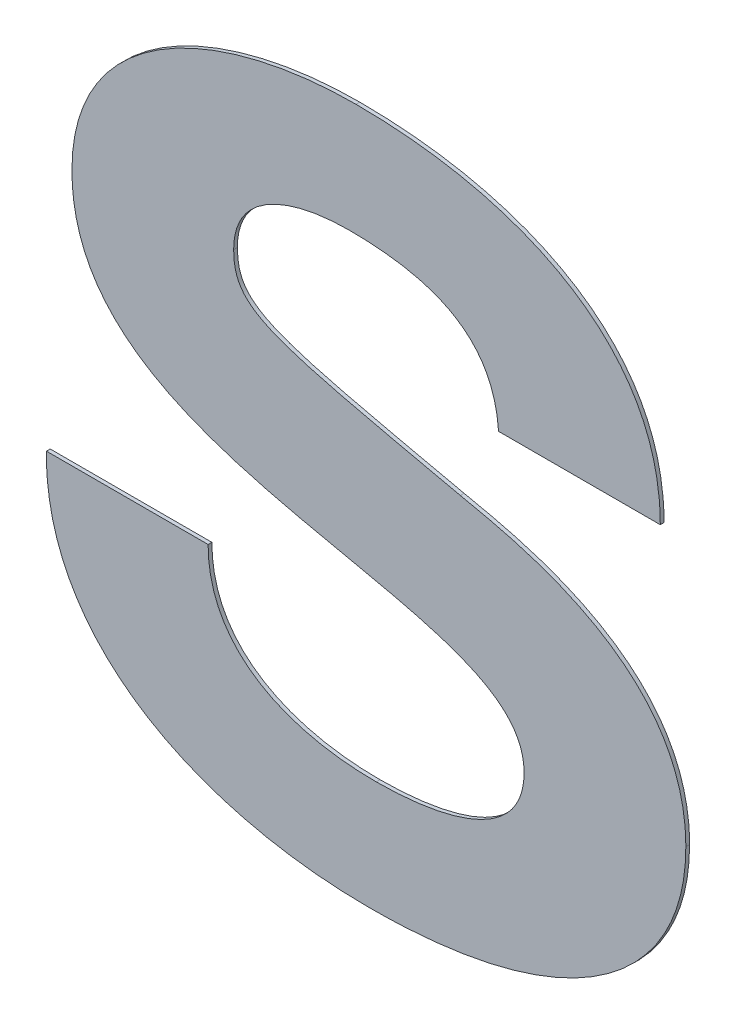
ISO-10303-21;
HEADER;
FILE_DESCRIPTION(('STEP AP214'),'2;1');
FILE_NAME('part.step','',(''),(''),'','','');
FILE_SCHEMA(('AUTOMOTIVE_DESIGN { 1 0 10303 214 1 1 1 1 }'));
ENDSEC;
DATA;
#1=APPLICATION_CONTEXT('core data for automotive mechanical design processes');
#2=APPLICATION_PROTOCOL_DEFINITION('international standard','automotive_design',2000,#1);
#3=PRODUCT_CONTEXT('',#1,'mechanical');
#4=PRODUCT('Part','Part','',(#3));
#5=PRODUCT_RELATED_PRODUCT_CATEGORY('part','',(#4));
#6=PRODUCT_DEFINITION_FORMATION('','',#4);
#7=PRODUCT_DEFINITION_CONTEXT('part definition',#1,'design');
#8=PRODUCT_DEFINITION('design','',#6,#7);
#9=PRODUCT_DEFINITION_SHAPE('','',#8);
#10=(LENGTH_UNIT() NAMED_UNIT(*) SI_UNIT(.MILLI.,.METRE.));
#11=(NAMED_UNIT(*) PLANE_ANGLE_UNIT() SI_UNIT($,.RADIAN.));
#12=(NAMED_UNIT(*) SI_UNIT($,.STERADIAN.) SOLID_ANGLE_UNIT());
#13=UNCERTAINTY_MEASURE_WITH_UNIT(LENGTH_MEASURE(1.E-05),#10,'distance_accuracy_value','');
#14=(GEOMETRIC_REPRESENTATION_CONTEXT(3) GLOBAL_UNCERTAINTY_ASSIGNED_CONTEXT((#13)) GLOBAL_UNIT_ASSIGNED_CONTEXT((#10,
#11,#12)) REPRESENTATION_CONTEXT('',''));
#15=CARTESIAN_POINT('',(0.,0.,0.));
#16=DIRECTION('',(0.,0.,1.));
#17=DIRECTION('',(1.,0.,0.));
#18=AXIS2_PLACEMENT_3D('',#15,#16,#17);
#19=CARTESIAN_POINT('',(-0.0731636384656502,0.908408728267,0.00015));
#20=CARTESIAN_POINT('',(-0.0731636384656502,0.908408728267,-3.E-05));
#21=CARTESIAN_POINT('',(-0.0731636384656502,0.904916966137,0.00015));
#22=CARTESIAN_POINT('',(-0.0731636384656502,0.904916966137,-3.E-05));
#23=CARTESIAN_POINT('',(-0.0700192920323502,0.90355574770965,0.00015));
#24=CARTESIAN_POINT('',(-0.0700192920323502,0.90355574770965,-3.E-05));
#25=CARTESIAN_POINT('',(-0.0664503274490002,0.90355574770965,0.00015));
#26=CARTESIAN_POINT('',(-0.0664503274490002,0.90355574770965,-3.E-05));
#27=B_SPLINE_SURFACE_WITH_KNOTS('',3,1,((#19,#20),(#21,#22),(#23,#24),(#25,#26)),.UNSPECIFIED.,
.F.,.F.,.F.,(4,4),(2,2),(0.,1.),(0.,0.00036),.UNSPECIFIED.);
#28=DIRECTION('',(0.,0.,1.));
#29=VECTOR('',#28,1.);
#30=CARTESIAN_POINT('',(-0.0731636384656502,0.908408728267,0.));
#31=LINE('',#30,#29);
#32=CARTESIAN_POINT('',(-0.0731636384656502,0.908408728267,0.));
#33=VERTEX_POINT('',#32);
#34=CARTESIAN_POINT('',(-0.0731636384656502,0.908408728267,0.00015));
#35=VERTEX_POINT('',#34);
#36=EDGE_CURVE('E11',#33,#35,#31,.T.);
#37=CARTESIAN_POINT('',(-0.0731636384656502,0.908408728267,0.00015));
#38=CARTESIAN_POINT('',(-0.0731636384656502,0.904916966137,0.00015));
#39=CARTESIAN_POINT('',(-0.0700192920323502,0.90355574770965,0.00015));
#40=CARTESIAN_POINT('',(-0.0664503274490002,0.90355574770965,0.00015));
#41=B_SPLINE_CURVE_WITH_KNOTS('',3,(#37,#38,#39,#40),.UNSPECIFIED.,.F.,.F.,(4,4),(0.,1.),.UNSPECIFIED.);
#42=CARTESIAN_POINT('',(-0.0664503274490002,0.90355574770965,0.00015));
#43=VERTEX_POINT('',#42);
#44=EDGE_CURVE('E26',#35,#43,#41,.T.);
#45=DIRECTION('',(0.,0.,1.));
#46=VECTOR('',#45,1.);
#47=CARTESIAN_POINT('',(-0.0664503274490002,0.90355574770965,0.));
#48=LINE('',#47,#46);
#49=CARTESIAN_POINT('',(-0.0664503274490002,0.90355574770965,0.));
#50=VERTEX_POINT('',#49);
#51=EDGE_CURVE('E339',#50,#43,#48,.T.);
#52=CARTESIAN_POINT('',(-0.0731636384656502,0.908408728267,0.));
#53=CARTESIAN_POINT('',(-0.0731636384656502,0.904916966137,0.));
#54=CARTESIAN_POINT('',(-0.0700192920323502,0.90355574770965,0.));
#55=CARTESIAN_POINT('',(-0.0664503274490002,0.90355574770965,0.));
#56=B_SPLINE_CURVE_WITH_KNOTS('',3,(#52,#53,#54,#55),.UNSPECIFIED.,.F.,.F.,(4,4),(0.,1.),.UNSPECIFIED.);
#57=EDGE_CURVE('E332',#33,#50,#56,.T.);
#58=ORIENTED_EDGE('',*,*,#36,.T.);
#59=ORIENTED_EDGE('',*,*,#44,.T.);
#60=ORIENTED_EDGE('',*,*,#51,.F.);
#61=ORIENTED_EDGE('',*,*,#57,.F.);
#62=EDGE_LOOP('',(#58,#59,#60,#61));
#63=FACE_BOUND('',#62,.T.);
#64=ADVANCED_FACE('F17',(#63),#27,.T.);
#65=CARTESIAN_POINT('',(-0.0664503274490002,0.90355574770965,0.00015));
#66=CARTESIAN_POINT('',(-0.0664503274490002,0.90355574770965,-3.E-05));
#67=CARTESIAN_POINT('',(-0.0641139063323502,0.90355574770965,0.00015));
#68=CARTESIAN_POINT('',(-0.0641139063323502,0.90355574770965,-3.E-05));
#69=CARTESIAN_POINT('',(-0.0605456190823502,0.9041435773485,0.00015));
#70=CARTESIAN_POINT('',(-0.0605456190823502,0.9041435773485,-3.E-05));
#71=CARTESIAN_POINT('',(-0.0605456190823502,0.90683079856365,0.00015));
#72=CARTESIAN_POINT('',(-0.0605456190823502,0.90683079856365,-3.E-05));
#73=B_SPLINE_SURFACE_WITH_KNOTS('',3,1,((#65,#66),(#67,#68),(#69,#70),(#71,#72)),.UNSPECIFIED.,
.F.,.F.,.F.,(4,4),(2,2),(0.,1.),(0.,0.00036),.UNSPECIFIED.);
#74=CARTESIAN_POINT('',(-0.0664503274490002,0.90355574770965,0.00015));
#75=CARTESIAN_POINT('',(-0.0641139063323502,0.90355574770965,0.00015));
#76=CARTESIAN_POINT('',(-0.0605456190823502,0.9041435773485,0.00015));
#77=CARTESIAN_POINT('',(-0.0605456190823502,0.90683079856365,0.00015));
#78=B_SPLINE_CURVE_WITH_KNOTS('',3,(#74,#75,#76,#77),.UNSPECIFIED.,.F.,.F.,(4,4),(0.,1.),.UNSPECIFIED.);
#79=CARTESIAN_POINT('',(-0.0605456190823502,0.90683079856365,0.00015));
#80=VERTEX_POINT('',#79);
#81=EDGE_CURVE('E328',#43,#80,#78,.T.);
#82=DIRECTION('',(0.,0.,1.));
#83=VECTOR('',#82,1.);
#84=CARTESIAN_POINT('',(-0.0605456190823502,0.90683079856365,0.));
#85=LINE('',#84,#83);
#86=CARTESIAN_POINT('',(-0.0605456190823502,0.90683079856365,0.));
#87=VERTEX_POINT('',#86);
#88=EDGE_CURVE('E322',#87,#80,#85,.T.);
#89=CARTESIAN_POINT('',(-0.0664503274490002,0.90355574770965,0.));
#90=CARTESIAN_POINT('',(-0.0641139063323502,0.90355574770965,0.));
#91=CARTESIAN_POINT('',(-0.0605456190823502,0.9041435773485,0.));
#92=CARTESIAN_POINT('',(-0.0605456190823502,0.90683079856365,0.));
#93=B_SPLINE_CURVE_WITH_KNOTS('',3,(#89,#90,#91,#92),.UNSPECIFIED.,.F.,.F.,(4,4),(0.,1.),.UNSPECIFIED.);
#94=EDGE_CURVE('E314',#50,#87,#93,.T.);
#95=ORIENTED_EDGE('',*,*,#51,.T.);
#96=ORIENTED_EDGE('',*,*,#81,.T.);
#97=ORIENTED_EDGE('',*,*,#88,.F.);
#98=ORIENTED_EDGE('',*,*,#94,.F.);
#99=EDGE_LOOP('',(#95,#96,#97,#98));
#100=FACE_BOUND('',#99,.T.);
#101=ADVANCED_FACE('F353',(#100),#73,.T.);
#102=CARTESIAN_POINT('',(-0.0605456190823502,0.90683079856365,0.00015));
#103=CARTESIAN_POINT('',(-0.0605456190823502,0.90683079856365,-3.E-05));
#104=CARTESIAN_POINT('',(-0.0605456190823502,0.909661590887,0.00015));
#105=CARTESIAN_POINT('',(-0.0605456190823502,0.909661590887,-3.E-05));
#106=CARTESIAN_POINT('',(-0.0650904622490002,0.910142419448667,0.00015));
#107=CARTESIAN_POINT('',(-0.0650904622490002,0.910142419448667,-3.E-05));
#108=CARTESIAN_POINT('',(-0.0695513308990002,0.911171798475333,0.00015));
#109=CARTESIAN_POINT('',(-0.0695513308990002,0.911171798475333,-3.E-05));
#110=B_SPLINE_SURFACE_WITH_KNOTS('',3,1,((#102,#103),(#104,#105),(#106,#107),(#108,#109)),
.UNSPECIFIED.,.F.,.F.,.F.,(4,4),(2,2),(0.,1.),(0.,0.00036),.UNSPECIFIED.);
#111=CARTESIAN_POINT('',(-0.0605456190823502,0.90683079856365,0.00015));
#112=CARTESIAN_POINT('',(-0.0605456190823502,0.909661590887,0.00015));
#113=CARTESIAN_POINT('',(-0.0650904622490002,0.910142419448667,0.00015));
#114=CARTESIAN_POINT('',(-0.0695513308990002,0.911171798475333,0.00015));
#115=B_SPLINE_CURVE_WITH_KNOTS('',3,(#111,#112,#113,#114),.UNSPECIFIED.,.F.,.F.,(4,4),(0.,1.),.UNSPECIFIED.);
#116=CARTESIAN_POINT('',(-0.0695513308990002,0.911171798475333,0.00015));
#117=VERTEX_POINT('',#116);
#118=EDGE_CURVE('E310',#80,#117,#115,.T.);
#119=DIRECTION('',(0.,0.,1.));
#120=VECTOR('',#119,1.);
#121=CARTESIAN_POINT('',(-0.0695513308990002,0.911171798475333,0.));
#122=LINE('',#121,#120);
#123=CARTESIAN_POINT('',(-0.0695513308990002,0.911171798475333,0.));
#124=VERTEX_POINT('',#123);
#125=EDGE_CURVE('E304',#124,#117,#122,.T.);
#126=CARTESIAN_POINT('',(-0.0605456190823502,0.90683079856365,0.));
#127=CARTESIAN_POINT('',(-0.0605456190823502,0.909661590887,0.));
#128=CARTESIAN_POINT('',(-0.0650904622490002,0.910142419448667,0.));
#129=CARTESIAN_POINT('',(-0.0695513308990002,0.911171798475333,0.));
#130=B_SPLINE_CURVE_WITH_KNOTS('',3,(#126,#127,#128,#129),.UNSPECIFIED.,.F.,.F.,(4,4),(0.,1.),.UNSPECIFIED.);
#131=EDGE_CURVE('E296',#87,#124,#130,.T.);
#132=ORIENTED_EDGE('',*,*,#88,.T.);
#133=ORIENTED_EDGE('',*,*,#118,.T.);
#134=ORIENTED_EDGE('',*,*,#125,.F.);
#135=ORIENTED_EDGE('',*,*,#131,.F.);
#136=EDGE_LOOP('',(#132,#133,#134,#135));
#137=FACE_BOUND('',#136,.T.);
#138=ADVANCED_FACE('F359',(#137),#110,.T.);
#139=CARTESIAN_POINT('',(-0.0695513308990002,0.911171798475333,0.00015));
#140=CARTESIAN_POINT('',(-0.0695513308990002,0.911171798475333,-3.E-05));
#141=CARTESIAN_POINT('',(-0.0740562198656502,0.912201177502,0.00015));
#142=CARTESIAN_POINT('',(-0.0740562198656502,0.912201177502,-3.E-05));
#143=CARTESIAN_POINT('',(-0.0786017403656502,0.913711384878667,0.00015));
#144=CARTESIAN_POINT('',(-0.0786017403656502,0.913711384878667,-3.E-05));
#145=CARTESIAN_POINT('',(-0.0786017403656502,0.918634796630333,0.00015));
#146=CARTESIAN_POINT('',(-0.0786017403656502,0.918634796630333,-3.E-05));
#147=B_SPLINE_SURFACE_WITH_KNOTS('',3,1,((#139,#140),(#141,#142),(#143,#144),(#145,#146)),
.UNSPECIFIED.,.F.,.F.,.F.,(4,4),(2,2),(0.,1.),(0.,0.00036),.UNSPECIFIED.);
#148=CARTESIAN_POINT('',(-0.0695513308990002,0.911171798475333,0.00015));
#149=CARTESIAN_POINT('',(-0.0740562198656502,0.912201177502,0.00015));
#150=CARTESIAN_POINT('',(-0.0786017403656502,0.913711384878667,0.00015));
#151=CARTESIAN_POINT('',(-0.0786017403656502,0.918634796630333,0.00015));
#152=B_SPLINE_CURVE_WITH_KNOTS('',3,(#148,#149,#150,#151),.UNSPECIFIED.,.F.,.F.,(4,4),(0.,1.),.UNSPECIFIED.);
#153=CARTESIAN_POINT('',(-0.0786017403656502,0.918634796630333,0.00015));
#154=VERTEX_POINT('',#153);
#155=EDGE_CURVE('E292',#117,#154,#152,.T.);
#156=DIRECTION('',(0.,0.,1.));
#157=VECTOR('',#156,1.);
#158=CARTESIAN_POINT('',(-0.0786017403656502,0.918634796630333,0.));
#159=LINE('',#158,#157);
#160=CARTESIAN_POINT('',(-0.0786017403656502,0.918634796630333,0.));
#161=VERTEX_POINT('',#160);
#162=EDGE_CURVE('E286',#161,#154,#159,.T.);
#163=CARTESIAN_POINT('',(-0.0695513308990002,0.911171798475333,0.));
#164=CARTESIAN_POINT('',(-0.0740562198656502,0.912201177502,0.));
#165=CARTESIAN_POINT('',(-0.0786017403656502,0.913711384878667,0.));
#166=CARTESIAN_POINT('',(-0.0786017403656502,0.918634796630333,0.));
#167=B_SPLINE_CURVE_WITH_KNOTS('',3,(#163,#164,#165,#166),.UNSPECIFIED.,.F.,.F.,(4,4),(0.,1.),.UNSPECIFIED.);
#168=EDGE_CURVE('E278',#124,#161,#167,.T.);
#169=ORIENTED_EDGE('',*,*,#125,.T.);
#170=ORIENTED_EDGE('',*,*,#155,.T.);
#171=ORIENTED_EDGE('',*,*,#162,.F.);
#172=ORIENTED_EDGE('',*,*,#168,.F.);
#173=EDGE_LOOP('',(#169,#170,#171,#172));
#174=FACE_BOUND('',#173,.T.);
#175=ADVANCED_FACE('F363',(#174),#147,.T.);
#176=CARTESIAN_POINT('',(-0.0786017403656502,0.918634796630333,0.00015));
#177=CARTESIAN_POINT('',(-0.0786017403656502,0.918634796630333,-3.E-05));
#178=CARTESIAN_POINT('',(-0.0786017403656502,0.92400517578035,0.00015));
#179=CARTESIAN_POINT('',(-0.0786017403656502,0.92400517578035,-3.E-05));
#180=CARTESIAN_POINT('',(-0.0727390203156502,0.92658539668035,0.00015));
#181=CARTESIAN_POINT('',(-0.0727390203156502,0.92658539668035,-3.E-05));
#182=CARTESIAN_POINT('',(-0.0672582527656502,0.92658539668035,0.00015));
#183=CARTESIAN_POINT('',(-0.0672582527656502,0.92658539668035,-3.E-05));
#184=B_SPLINE_SURFACE_WITH_KNOTS('',3,1,((#176,#177),(#178,#179),(#180,#181),(#182,#183)),
.UNSPECIFIED.,.F.,.F.,.F.,(4,4),(2,2),(0.,1.),(0.,0.00036),.UNSPECIFIED.);
#185=CARTESIAN_POINT('',(-0.0786017403656502,0.918634796630333,0.00015));
#186=CARTESIAN_POINT('',(-0.0786017403656502,0.92400517578035,0.00015));
#187=CARTESIAN_POINT('',(-0.0727390203156502,0.92658539668035,0.00015));
#188=CARTESIAN_POINT('',(-0.0672582527656502,0.92658539668035,0.00015));
#189=B_SPLINE_CURVE_WITH_KNOTS('',3,(#185,#186,#187,#188),.UNSPECIFIED.,.F.,.F.,(4,4),(0.,1.),.UNSPECIFIED.);
#190=CARTESIAN_POINT('',(-0.0672582527656502,0.92658539668035,0.00015));
#191=VERTEX_POINT('',#190);
#192=EDGE_CURVE('E274',#154,#191,#189,.T.);
#193=DIRECTION('',(0.,0.,1.));
#194=VECTOR('',#193,1.);
#195=CARTESIAN_POINT('',(-0.0672582527656502,0.92658539668035,0.));
#196=LINE('',#195,#194);
#197=CARTESIAN_POINT('',(-0.0672582527656502,0.92658539668035,0.));
#198=VERTEX_POINT('',#197);
#199=EDGE_CURVE('E268',#198,#191,#196,.T.);
#200=CARTESIAN_POINT('',(-0.0786017403656502,0.918634796630333,0.));
#201=CARTESIAN_POINT('',(-0.0786017403656502,0.92400517578035,0.));
#202=CARTESIAN_POINT('',(-0.0727390203156502,0.92658539668035,0.));
#203=CARTESIAN_POINT('',(-0.0672582527656502,0.92658539668035,0.));
#204=B_SPLINE_CURVE_WITH_KNOTS('',3,(#200,#201,#202,#203),.UNSPECIFIED.,.F.,.F.,(4,4),(0.,1.),.UNSPECIFIED.);
#205=EDGE_CURVE('E260',#161,#198,#204,.T.);
#206=ORIENTED_EDGE('',*,*,#162,.T.);
#207=ORIENTED_EDGE('',*,*,#192,.T.);
#208=ORIENTED_EDGE('',*,*,#199,.F.);
#209=ORIENTED_EDGE('',*,*,#205,.F.);
#210=EDGE_LOOP('',(#206,#207,#208,#209));
#211=FACE_BOUND('',#210,.T.);
#212=ADVANCED_FACE('F367',(#211),#184,.T.);
#213=CARTESIAN_POINT('',(-0.0672582527656502,0.92658539668035,0.00015));
#214=CARTESIAN_POINT('',(-0.0672582527656502,0.92658539668035,-3.E-05));
#215=CARTESIAN_POINT('',(-0.0609275715823502,0.92658539668035,0.00015));
#216=CARTESIAN_POINT('',(-0.0609275715823502,0.92658539668035,-3.E-05));
#217=CARTESIAN_POINT('',(-0.0551061625156502,0.924188026147,0.00015));
#218=CARTESIAN_POINT('',(-0.0551061625156502,0.924188026147,-3.E-05));
#219=CARTESIAN_POINT('',(-0.0551061625156502,0.918120107117,0.00015));
#220=CARTESIAN_POINT('',(-0.0551061625156502,0.918120107117,-3.E-05));
#221=B_SPLINE_SURFACE_WITH_KNOTS('',3,1,((#213,#214),(#215,#216),(#217,#218),(#219,#220)),
.UNSPECIFIED.,.F.,.F.,.F.,(4,4),(2,2),(0.,1.),(0.,0.00036),.UNSPECIFIED.);
#222=CARTESIAN_POINT('',(-0.0672582527656502,0.92658539668035,0.00015));
#223=CARTESIAN_POINT('',(-0.0609275715823502,0.92658539668035,0.00015));
#224=CARTESIAN_POINT('',(-0.0551061625156502,0.924188026147,0.00015));
#225=CARTESIAN_POINT('',(-0.0551061625156502,0.918120107117,0.00015));
#226=B_SPLINE_CURVE_WITH_KNOTS('',3,(#222,#223,#224,#225),.UNSPECIFIED.,.F.,.F.,(4,4),(0.,1.),.UNSPECIFIED.);
#227=CARTESIAN_POINT('',(-0.0551061625156502,0.918120107117,0.00015));
#228=VERTEX_POINT('',#227);
#229=EDGE_CURVE('E256',#191,#228,#226,.T.);
#230=DIRECTION('',(0.,0.,1.));
#231=VECTOR('',#230,1.);
#232=CARTESIAN_POINT('',(-0.0551061625156502,0.918120107117,0.));
#233=LINE('',#232,#231);
#234=CARTESIAN_POINT('',(-0.0551061625156502,0.918120107117,0.));
#235=VERTEX_POINT('',#234);
#236=EDGE_CURVE('E250',#235,#228,#233,.T.);
#237=CARTESIAN_POINT('',(-0.0672582527656502,0.92658539668035,0.));
#238=CARTESIAN_POINT('',(-0.0609275715823502,0.92658539668035,0.));
#239=CARTESIAN_POINT('',(-0.0551061625156502,0.924188026147,0.));
#240=CARTESIAN_POINT('',(-0.0551061625156502,0.918120107117,0.));
#241=B_SPLINE_CURVE_WITH_KNOTS('',3,(#237,#238,#239,#240),.UNSPECIFIED.,.F.,.F.,(4,4),(0.,1.),.UNSPECIFIED.);
#242=EDGE_CURVE('E245',#198,#235,#241,.T.);
#243=ORIENTED_EDGE('',*,*,#199,.T.);
#244=ORIENTED_EDGE('',*,*,#229,.T.);
#245=ORIENTED_EDGE('',*,*,#236,.F.);
#246=ORIENTED_EDGE('',*,*,#242,.F.);
#247=EDGE_LOOP('',(#243,#244,#245,#246));
#248=FACE_BOUND('',#247,.T.);
#249=ADVANCED_FACE('F370',(#248),#221,.T.);
#250=CARTESIAN_POINT('',(-0.0583355005240002,0.918120107117,0.00015));
#251=DIRECTION('',(0.,-1.,0.));
#252=DIRECTION('',(0.,0.,-1.));
#253=AXIS2_PLACEMENT_3D('',#250,#251,#252);
#254=PLANE('',#253);
#255=ORIENTED_EDGE('',*,*,#236,.T.);
#256=DIRECTION('',(-1.,0.,0.));
#257=VECTOR('',#256,1.);
#258=CARTESIAN_POINT('',(-0.0551061625156502,0.918120107117,0.00015));
#259=LINE('',#258,#257);
#260=CARTESIAN_POINT('',(-0.0615648385323502,0.918120107117,0.00015));
#261=VERTEX_POINT('',#260);
#262=EDGE_CURVE('E243',#228,#261,#259,.T.);
#263=ORIENTED_EDGE('',*,*,#262,.T.);
#264=DIRECTION('',(0.,0.,1.));
#265=VECTOR('',#264,1.);
#266=CARTESIAN_POINT('',(-0.0615648385323502,0.918120107117,0.));
#267=LINE('',#266,#265);
#268=CARTESIAN_POINT('',(-0.0615648385323502,0.918120107117,0.));
#269=VERTEX_POINT('',#268);
#270=EDGE_CURVE('E240',#269,#261,#267,.T.);
#271=ORIENTED_EDGE('',*,*,#270,.F.);
#272=DIRECTION('',(-1.,0.,0.));
#273=VECTOR('',#272,1.);
#274=CARTESIAN_POINT('',(-0.0551061625156502,0.918120107117,0.));
#275=LINE('',#274,#273);
#276=EDGE_CURVE('E234',#235,#269,#275,.T.);
#277=ORIENTED_EDGE('',*,*,#276,.F.);
#278=EDGE_LOOP('',(#255,#263,#271,#277));
#279=FACE_BOUND('',#278,.T.);
#280=ADVANCED_FACE('F375',(#279),#254,.T.);
#281=CARTESIAN_POINT('',(-0.0615648385323502,0.918120107117,0.00015));
#282=CARTESIAN_POINT('',(-0.0615648385323502,0.918120107117,-3.E-05));
#283=CARTESIAN_POINT('',(-0.0617774873323502,0.92128273901035,0.00015));
#284=CARTESIAN_POINT('',(-0.0617774873323502,0.92128273901035,-3.E-05));
#285=CARTESIAN_POINT('',(-0.0643685434490002,0.92209540671865,0.00015));
#286=CARTESIAN_POINT('',(-0.0643685434490002,0.92209540671865,-3.E-05));
#287=CARTESIAN_POINT('',(-0.0675562307490002,0.92209540671865,0.00015));
#288=CARTESIAN_POINT('',(-0.0675562307490002,0.92209540671865,-3.E-05));
#289=B_SPLINE_SURFACE_WITH_KNOTS('',3,1,((#281,#282),(#283,#284),(#285,#286),(#287,#288)),
.UNSPECIFIED.,.F.,.F.,.F.,(4,4),(2,2),(0.,1.),(0.,0.00036),.UNSPECIFIED.);
#290=CARTESIAN_POINT('',(-0.0615648385323502,0.918120107117,0.00015));
#291=CARTESIAN_POINT('',(-0.0617774873323502,0.92128273901035,0.00015));
#292=CARTESIAN_POINT('',(-0.0643685434490002,0.92209540671865,0.00015));
#293=CARTESIAN_POINT('',(-0.0675562307490002,0.92209540671865,0.00015));
#294=B_SPLINE_CURVE_WITH_KNOTS('',3,(#290,#291,#292,#293),.UNSPECIFIED.,.F.,.F.,(4,4),(0.,1.),.UNSPECIFIED.);
#295=CARTESIAN_POINT('',(-0.0675562307490002,0.92209540671865,0.00015));
#296=VERTEX_POINT('',#295);
#297=EDGE_CURVE('E230',#261,#296,#294,.T.);
#298=DIRECTION('',(0.,0.,1.));
#299=VECTOR('',#298,1.);
#300=CARTESIAN_POINT('',(-0.0675562307490002,0.92209540671865,0.));
#301=LINE('',#300,#299);
#302=CARTESIAN_POINT('',(-0.0675562307490002,0.92209540671865,0.));
#303=VERTEX_POINT('',#302);
#304=EDGE_CURVE('E224',#303,#296,#301,.T.);
#305=CARTESIAN_POINT('',(-0.0615648385323502,0.918120107117,0.));
#306=CARTESIAN_POINT('',(-0.0617774873323502,0.92128273901035,0.));
#307=CARTESIAN_POINT('',(-0.0643685434490002,0.92209540671865,0.));
#308=CARTESIAN_POINT('',(-0.0675562307490002,0.92209540671865,0.));
#309=B_SPLINE_CURVE_WITH_KNOTS('',3,(#305,#306,#307,#308),.UNSPECIFIED.,.F.,.F.,(4,4),(0.,1.),.UNSPECIFIED.);
#310=EDGE_CURVE('E216',#269,#303,#309,.T.);
#311=ORIENTED_EDGE('',*,*,#270,.T.);
#312=ORIENTED_EDGE('',*,*,#297,.T.);
#313=ORIENTED_EDGE('',*,*,#304,.F.);
#314=ORIENTED_EDGE('',*,*,#310,.F.);
#315=EDGE_LOOP('',(#311,#312,#313,#314));
#316=FACE_BOUND('',#315,.T.);
#317=ADVANCED_FACE('F379',(#316),#289,.T.);
#318=CARTESIAN_POINT('',(-0.0675562307490002,0.92209540671865,0.00015));
#319=CARTESIAN_POINT('',(-0.0675562307490002,0.92209540671865,-3.E-05));
#320=CARTESIAN_POINT('',(-0.0696800030656502,0.92209540671865,0.00015));
#321=CARTESIAN_POINT('',(-0.0696800030656502,0.92209540671865,-3.E-05));
#322=CARTESIAN_POINT('',(-0.0721437416823502,0.921323372237,0.00015));
#323=CARTESIAN_POINT('',(-0.0721437416823502,0.921323372237,-3.E-05));
#324=CARTESIAN_POINT('',(-0.0721437416823502,0.919115625192,0.00015));
#325=CARTESIAN_POINT('',(-0.0721437416823502,0.919115625192,-3.E-05));
#326=B_SPLINE_SURFACE_WITH_KNOTS('',3,1,((#318,#319),(#320,#321),(#322,#323),(#324,#325)),
.UNSPECIFIED.,.F.,.F.,.F.,(4,4),(2,2),(0.,1.),(0.,0.00036),.UNSPECIFIED.);
#327=CARTESIAN_POINT('',(-0.0675562307490002,0.92209540671865,0.00015));
#328=CARTESIAN_POINT('',(-0.0696800030656502,0.92209540671865,0.00015));
#329=CARTESIAN_POINT('',(-0.0721437416823502,0.921323372237,0.00015));
#330=CARTESIAN_POINT('',(-0.0721437416823502,0.919115625192,0.00015));
#331=B_SPLINE_CURVE_WITH_KNOTS('',3,(#327,#328,#329,#330),.UNSPECIFIED.,.F.,.F.,(4,4),(0.,1.),.UNSPECIFIED.);
#332=CARTESIAN_POINT('',(-0.0721437416823502,0.919115625192,0.00015));
#333=VERTEX_POINT('',#332);
#334=EDGE_CURVE('E212',#296,#333,#331,.T.);
#335=DIRECTION('',(0.,0.,1.));
#336=VECTOR('',#335,1.);
#337=CARTESIAN_POINT('',(-0.0721437416823502,0.919115625192,0.));
#338=LINE('',#337,#336);
#339=CARTESIAN_POINT('',(-0.0721437416823502,0.919115625192,0.));
#340=VERTEX_POINT('',#339);
#341=EDGE_CURVE('E206',#340,#333,#338,.T.);
#342=CARTESIAN_POINT('',(-0.0675562307490002,0.92209540671865,0.));
#343=CARTESIAN_POINT('',(-0.0696800030656502,0.92209540671865,0.));
#344=CARTESIAN_POINT('',(-0.0721437416823502,0.921323372237,0.));
#345=CARTESIAN_POINT('',(-0.0721437416823502,0.919115625192,0.));
#346=B_SPLINE_CURVE_WITH_KNOTS('',3,(#342,#343,#344,#345),.UNSPECIFIED.,.F.,.F.,(4,4),(0.,1.),.UNSPECIFIED.);
#347=EDGE_CURVE('E198',#303,#340,#346,.T.);
#348=ORIENTED_EDGE('',*,*,#304,.T.);
#349=ORIENTED_EDGE('',*,*,#334,.T.);
#350=ORIENTED_EDGE('',*,*,#341,.F.);
#351=ORIENTED_EDGE('',*,*,#347,.F.);
#352=EDGE_LOOP('',(#348,#349,#350,#351));
#353=FACE_BOUND('',#352,.T.);
#354=ADVANCED_FACE('F383',(#353),#326,.T.);
#355=CARTESIAN_POINT('',(-0.0721437416823502,0.919115625192,0.00015));
#356=CARTESIAN_POINT('',(-0.0721437416823502,0.919115625192,-3.E-05));
#357=CARTESIAN_POINT('',(-0.0721437416823502,0.917090728090333,0.00015));
#358=CARTESIAN_POINT('',(-0.0721437416823502,0.917090728090333,-3.E-05));
#359=CARTESIAN_POINT('',(-0.0706999019656502,0.916833383333667,0.00015));
#360=CARTESIAN_POINT('',(-0.0706999019656502,0.916833383333667,-3.E-05));
#361=CARTESIAN_POINT('',(-0.0630940095490002,0.915140325590333,0.00015));
#362=CARTESIAN_POINT('',(-0.0630940095490002,0.915140325590333,-3.E-05));
#363=B_SPLINE_SURFACE_WITH_KNOTS('',3,1,((#355,#356),(#357,#358),(#359,#360),(#361,#362)),
.UNSPECIFIED.,.F.,.F.,.F.,(4,4),(2,2),(0.,1.),(0.,0.00036),.UNSPECIFIED.);
#364=CARTESIAN_POINT('',(-0.0721437416823502,0.919115625192,0.00015));
#365=CARTESIAN_POINT('',(-0.0721437416823502,0.917090728090333,0.00015));
#366=CARTESIAN_POINT('',(-0.0706999019656502,0.916833383333667,0.00015));
#367=CARTESIAN_POINT('',(-0.0630940095490002,0.915140325590333,0.00015));
#368=B_SPLINE_CURVE_WITH_KNOTS('',3,(#364,#365,#366,#367),.UNSPECIFIED.,.F.,.F.,(4,4),(0.,1.),.UNSPECIFIED.);
#369=CARTESIAN_POINT('',(-0.0630940095490002,0.915140325590333,0.00015));
#370=VERTEX_POINT('',#369);
#371=EDGE_CURVE('E194',#333,#370,#368,.T.);
#372=DIRECTION('',(0.,0.,1.));
#373=VECTOR('',#372,1.);
#374=CARTESIAN_POINT('',(-0.0630940095490002,0.915140325590333,0.));
#375=LINE('',#374,#373);
#376=CARTESIAN_POINT('',(-0.0630940095490002,0.915140325590333,0.));
#377=VERTEX_POINT('',#376);
#378=EDGE_CURVE('E188',#377,#370,#375,.T.);
#379=CARTESIAN_POINT('',(-0.0721437416823502,0.919115625192,0.));
#380=CARTESIAN_POINT('',(-0.0721437416823502,0.917090728090333,0.));
#381=CARTESIAN_POINT('',(-0.0706999019656502,0.916833383333667,0.));
#382=CARTESIAN_POINT('',(-0.0630940095490002,0.915140325590333,0.));
#383=B_SPLINE_CURVE_WITH_KNOTS('',3,(#379,#380,#381,#382),.UNSPECIFIED.,.F.,.F.,(4,4),(0.,1.),.UNSPECIFIED.);
#384=EDGE_CURVE('E180',#340,#377,#383,.T.);
#385=ORIENTED_EDGE('',*,*,#341,.T.);
#386=ORIENTED_EDGE('',*,*,#371,.T.);
#387=ORIENTED_EDGE('',*,*,#378,.F.);
#388=ORIENTED_EDGE('',*,*,#384,.F.);
#389=EDGE_LOOP('',(#385,#386,#387,#388));
#390=FACE_BOUND('',#389,.T.);
#391=ADVANCED_FACE('F386',(#390),#363,.T.);
#392=CARTESIAN_POINT('',(-0.0630940095490002,0.915140325590333,0.00015));
#393=CARTESIAN_POINT('',(-0.0630940095490002,0.915140325590333,-3.E-05));
#394=CARTESIAN_POINT('',(-0.0608849080490002,0.914666269515333,0.00015));
#395=CARTESIAN_POINT('',(-0.0608849080490002,0.914666269515333,-3.E-05));
#396=CARTESIAN_POINT('',(-0.0540862657323502,0.913447268058667,0.00015));
#397=CARTESIAN_POINT('',(-0.0540862657323502,0.913447268058667,-3.E-05));
#398=CARTESIAN_POINT('',(-0.0540862657323502,0.90749447706865,0.00015));
#399=CARTESIAN_POINT('',(-0.0540862657323502,0.90749447706865,-3.E-05));
#400=B_SPLINE_SURFACE_WITH_KNOTS('',3,1,((#392,#393),(#394,#395),(#396,#397),(#398,#399)),
.UNSPECIFIED.,.F.,.F.,.F.,(4,4),(2,2),(0.,1.),(0.,0.00036),.UNSPECIFIED.);
#401=CARTESIAN_POINT('',(-0.0630940095490002,0.915140325590333,0.00015));
#402=CARTESIAN_POINT('',(-0.0608849080490002,0.914666269515333,0.00015));
#403=CARTESIAN_POINT('',(-0.0540862657323502,0.913447268058667,0.00015));
#404=CARTESIAN_POINT('',(-0.0540862657323502,0.90749447706865,0.00015));
#405=B_SPLINE_CURVE_WITH_KNOTS('',3,(#401,#402,#403,#404),.UNSPECIFIED.,.F.,.F.,(4,4),(0.,1.),.UNSPECIFIED.);
#406=CARTESIAN_POINT('',(-0.0540862657323502,0.90749447706865,0.00015));
#407=VERTEX_POINT('',#406);
#408=EDGE_CURVE('E176',#370,#407,#405,.T.);
#409=DIRECTION('',(0.,0.,1.));
#410=VECTOR('',#409,1.);
#411=CARTESIAN_POINT('',(-0.0540862657323502,0.90749447706865,0.));
#412=LINE('',#411,#410);
#413=CARTESIAN_POINT('',(-0.0540862657323502,0.90749447706865,0.));
#414=VERTEX_POINT('',#413);
#415=EDGE_CURVE('E170',#414,#407,#412,.T.);
#416=CARTESIAN_POINT('',(-0.0630940095490002,0.915140325590333,0.));
#417=CARTESIAN_POINT('',(-0.0608849080490002,0.914666269515333,0.));
#418=CARTESIAN_POINT('',(-0.0540862657323502,0.913447268058667,0.));
#419=CARTESIAN_POINT('',(-0.0540862657323502,0.90749447706865,0.));
#420=B_SPLINE_CURVE_WITH_KNOTS('',3,(#416,#417,#418,#419),.UNSPECIFIED.,.F.,.F.,(4,4),(0.,1.),.UNSPECIFIED.);
#421=EDGE_CURVE('E163',#377,#414,#420,.T.);
#422=ORIENTED_EDGE('',*,*,#378,.T.);
#423=ORIENTED_EDGE('',*,*,#408,.T.);
#424=ORIENTED_EDGE('',*,*,#415,.F.);
#425=ORIENTED_EDGE('',*,*,#421,.F.);
#426=EDGE_LOOP('',(#422,#423,#424,#425));
#427=FACE_BOUND('',#426,.T.);
#428=ADVANCED_FACE('F390',(#427),#400,.T.);
#429=CARTESIAN_POINT('',(-0.0540862657323502,0.90749447706865,0.00015));
#430=CARTESIAN_POINT('',(-0.0540862657323502,0.90749447706865,-3.E-05));
#431=CARTESIAN_POINT('',(-0.0540862657323502,0.90267197159855,0.00015));
#432=CARTESIAN_POINT('',(-0.0540862657323502,0.90267197159855,-3.E-05));
#433=CARTESIAN_POINT('',(-0.0584624804156502,0.899067113092,0.00015));
#434=CARTESIAN_POINT('',(-0.0584624804156502,0.899067113092,-3.E-05));
#435=CARTESIAN_POINT('',(-0.0667063171156502,0.899067113092,0.00015));
#436=CARTESIAN_POINT('',(-0.0667063171156502,0.899067113092,-3.E-05));
#437=B_SPLINE_SURFACE_WITH_KNOTS('',3,1,((#429,#430),(#431,#432),(#433,#434),(#435,#436)),
.UNSPECIFIED.,.F.,.F.,.F.,(4,4),(2,2),(0.,1.),(0.,0.00036),.UNSPECIFIED.);
#438=CARTESIAN_POINT('',(-0.0540862657323502,0.90749447706865,0.00015));
#439=CARTESIAN_POINT('',(-0.0540862657323502,0.90267197159855,0.00015));
#440=CARTESIAN_POINT('',(-0.0584624804156502,0.899067113092,0.00015));
#441=CARTESIAN_POINT('',(-0.0667063171156502,0.899067113092,0.00015));
#442=B_SPLINE_CURVE_WITH_KNOTS('',3,(#438,#439,#440,#441),.UNSPECIFIED.,.F.,.F.,(4,4),(0.,1.),.UNSPECIFIED.);
#443=CARTESIAN_POINT('',(-0.0667063171156502,0.899067113092,0.00015));
#444=VERTEX_POINT('',#443);
#445=EDGE_CURVE('E159',#407,#444,#442,.T.);
#446=DIRECTION('',(0.,0.,1.));
#447=VECTOR('',#446,1.);
#448=CARTESIAN_POINT('',(-0.0667063171156502,0.899067113092,0.));
#449=LINE('',#448,#447);
#450=CARTESIAN_POINT('',(-0.0667063171156502,0.899067113092,0.));
#451=VERTEX_POINT('',#450);
#452=EDGE_CURVE('E154',#451,#444,#449,.T.);
#453=CARTESIAN_POINT('',(-0.0540862657323502,0.90749447706865,0.));
#454=CARTESIAN_POINT('',(-0.0540862657323502,0.90267197159855,0.));
#455=CARTESIAN_POINT('',(-0.0584624804156502,0.899067113092,0.));
#456=CARTESIAN_POINT('',(-0.0667063171156502,0.899067113092,0.));
#457=B_SPLINE_CURVE_WITH_KNOTS('',3,(#453,#454,#455,#456),.UNSPECIFIED.,.F.,.F.,(4,4),(0.,1.),.UNSPECIFIED.);
#458=EDGE_CURVE('E133',#414,#451,#457,.T.);
#459=ORIENTED_EDGE('',*,*,#415,.T.);
#460=ORIENTED_EDGE('',*,*,#445,.T.);
#461=ORIENTED_EDGE('',*,*,#452,.F.);
#462=ORIENTED_EDGE('',*,*,#458,.F.);
#463=EDGE_LOOP('',(#459,#460,#461,#462));
#464=FACE_BOUND('',#463,.T.);
#465=ADVANCED_FACE('F393',(#464),#437,.T.);
#466=CARTESIAN_POINT('',(-0.0667063171156502,0.899067113092,0.00015));
#467=CARTESIAN_POINT('',(-0.0667063171156502,0.899067113092,-3.E-05));
#468=CARTESIAN_POINT('',(-0.0734189529156502,0.899067113092,0.00015));
#469=CARTESIAN_POINT('',(-0.0734189529156502,0.899067113092,-3.E-05));
#470=CARTESIAN_POINT('',(-0.0797056137823502,0.901937184568,0.00015));
#471=CARTESIAN_POINT('',(-0.0797056137823502,0.901937184568,-3.E-05));
#472=CARTESIAN_POINT('',(-0.0796209598156502,0.908408728267,0.00015));
#473=CARTESIAN_POINT('',(-0.0796209598156502,0.908408728267,-3.E-05));
#474=B_SPLINE_SURFACE_WITH_KNOTS('',3,1,((#466,#467),(#468,#469),(#470,#471),(#472,#473)),
.UNSPECIFIED.,.F.,.F.,.F.,(4,4),(2,2),(0.,1.),(0.,0.00036),.UNSPECIFIED.);
#475=CARTESIAN_POINT('',(-0.0667063171156502,0.899067113092,0.00015));
#476=CARTESIAN_POINT('',(-0.0734189529156502,0.899067113092,0.00015));
#477=CARTESIAN_POINT('',(-0.0797056137823502,0.901937184568,0.00015));
#478=CARTESIAN_POINT('',(-0.0796209598156502,0.908408728267,0.00015));
#479=B_SPLINE_CURVE_WITH_KNOTS('',3,(#475,#476,#477,#478),.UNSPECIFIED.,.F.,.F.,(4,4),(0.,1.),.UNSPECIFIED.);
#480=CARTESIAN_POINT('',(-0.0796209598156502,0.908408728267,0.00015));
#481=VERTEX_POINT('',#480);
#482=EDGE_CURVE('E122',#444,#481,#479,.T.);
#483=DIRECTION('',(0.,0.,1.));
#484=VECTOR('',#483,1.);
#485=CARTESIAN_POINT('',(-0.0796209598156502,0.908408728267,0.));
#486=LINE('',#485,#484);
#487=CARTESIAN_POINT('',(-0.0796209598156502,0.908408728267,0.));
#488=VERTEX_POINT('',#487);
#489=EDGE_CURVE('E116',#488,#481,#486,.T.);
#490=CARTESIAN_POINT('',(-0.0667063171156502,0.899067113092,0.));
#491=CARTESIAN_POINT('',(-0.0734189529156502,0.899067113092,0.));
#492=CARTESIAN_POINT('',(-0.0797056137823502,0.901937184568,0.));
#493=CARTESIAN_POINT('',(-0.0796209598156502,0.908408728267,0.));
#494=B_SPLINE_CURVE_WITH_KNOTS('',3,(#490,#491,#492,#493),.UNSPECIFIED.,.F.,.F.,(4,4),(0.,1.),.UNSPECIFIED.);
#495=EDGE_CURVE('E120',#451,#488,#494,.T.);
#496=ORIENTED_EDGE('',*,*,#452,.T.);
#497=ORIENTED_EDGE('',*,*,#482,.T.);
#498=ORIENTED_EDGE('',*,*,#489,.F.);
#499=ORIENTED_EDGE('',*,*,#495,.F.);
#500=EDGE_LOOP('',(#496,#497,#498,#499));
#501=FACE_BOUND('',#500,.T.);
#502=ADVANCED_FACE('F119',(#501),#474,.T.);
#503=CARTESIAN_POINT('',(-0.0763922991406502,0.908408728267,0.00015));
#504=DIRECTION('',(0.,1.,0.));
#505=DIRECTION('',(0.,0.,1.));
#506=AXIS2_PLACEMENT_3D('',#503,#504,#505);
#507=PLANE('',#506);
#508=ORIENTED_EDGE('',*,*,#489,.T.);
#509=DIRECTION('',(1.,0.,0.));
#510=VECTOR('',#509,1.);
#511=CARTESIAN_POINT('',(-0.0796209598156502,0.908408728267,0.00015));
#512=LINE('',#511,#510);
#513=EDGE_CURVE('E134',#481,#35,#512,.T.);
#514=ORIENTED_EDGE('',*,*,#513,.T.);
#515=ORIENTED_EDGE('',*,*,#36,.F.);
#516=DIRECTION('',(1.,0.,0.));
#517=VECTOR('',#516,1.);
#518=CARTESIAN_POINT('',(-0.0796209598156502,0.908408728267,0.));
#519=LINE('',#518,#517);
#520=EDGE_CURVE('E130',#488,#33,#519,.T.);
#521=ORIENTED_EDGE('',*,*,#520,.F.);
#522=EDGE_LOOP('',(#508,#514,#515,#521));
#523=FACE_BOUND('',#522,.T.);
#524=ADVANCED_FACE('F136',(#523),#507,.T.);
#525=CARTESIAN_POINT('',(-0.0668959397573502,0.899067113092,0.));
#526=DIRECTION('',(0.,0.,1.));
#527=DIRECTION('',(1.,0.,0.));
#528=AXIS2_PLACEMENT_3D('',#525,#526,#527);
#529=PLANE('',#528);
#530=ORIENTED_EDGE('',*,*,#57,.T.);
#531=ORIENTED_EDGE('',*,*,#94,.T.);
#532=ORIENTED_EDGE('',*,*,#131,.T.);
#533=ORIENTED_EDGE('',*,*,#168,.T.);
#534=ORIENTED_EDGE('',*,*,#205,.T.);
#535=ORIENTED_EDGE('',*,*,#242,.T.);
#536=ORIENTED_EDGE('',*,*,#276,.T.);
#537=ORIENTED_EDGE('',*,*,#310,.T.);
#538=ORIENTED_EDGE('',*,*,#347,.T.);
#539=ORIENTED_EDGE('',*,*,#384,.T.);
#540=ORIENTED_EDGE('',*,*,#421,.T.);
#541=ORIENTED_EDGE('',*,*,#458,.T.);
#542=ORIENTED_EDGE('',*,*,#495,.T.);
#543=ORIENTED_EDGE('',*,*,#520,.T.);
#544=EDGE_LOOP('',(#530,#531,#532,#533,#534,#535,#536,#537,#538,#539,#540,#541,#542,#543));
#545=FACE_BOUND('',#544,.T.);
#546=ADVANCED_FACE('F129',(#545),#529,.F.);
#547=CARTESIAN_POINT('',(-0.0668959397573502,0.899067113092,0.00015));
#548=DIRECTION('',(0.,0.,1.));
#549=DIRECTION('',(1.,0.,0.));
#550=AXIS2_PLACEMENT_3D('',#547,#548,#549);
#551=PLANE('',#550);
#552=ORIENTED_EDGE('',*,*,#44,.F.);
#553=ORIENTED_EDGE('',*,*,#513,.F.);
#554=ORIENTED_EDGE('',*,*,#482,.F.);
#555=ORIENTED_EDGE('',*,*,#445,.F.);
#556=ORIENTED_EDGE('',*,*,#408,.F.);
#557=ORIENTED_EDGE('',*,*,#371,.F.);
#558=ORIENTED_EDGE('',*,*,#334,.F.);
#559=ORIENTED_EDGE('',*,*,#297,.F.);
#560=ORIENTED_EDGE('',*,*,#262,.F.);
#561=ORIENTED_EDGE('',*,*,#229,.F.);
#562=ORIENTED_EDGE('',*,*,#192,.F.);
#563=ORIENTED_EDGE('',*,*,#155,.F.);
#564=ORIENTED_EDGE('',*,*,#118,.F.);
#565=ORIENTED_EDGE('',*,*,#81,.F.);
#566=EDGE_LOOP('',(#552,#553,#554,#555,#556,#557,#558,#559,#560,#561,#562,#563,#564,#565));
#567=FACE_BOUND('',#566,.T.);
#568=ADVANCED_FACE('F355',(#567),#551,.T.);
#569=CLOSED_SHELL('',(#64,#101,#138,#175,#212,#249,#280,#317,#354,#391,#428,#465,#502,#524,#546,#568));
#570=MANIFOLD_SOLID_BREP('B1',#569);
#571=ADVANCED_BREP_SHAPE_REPRESENTATION('',(#18,#570),#14);
#572=SHAPE_DEFINITION_REPRESENTATION(#9,#571);
ENDSEC;
END-ISO-10303-21;
